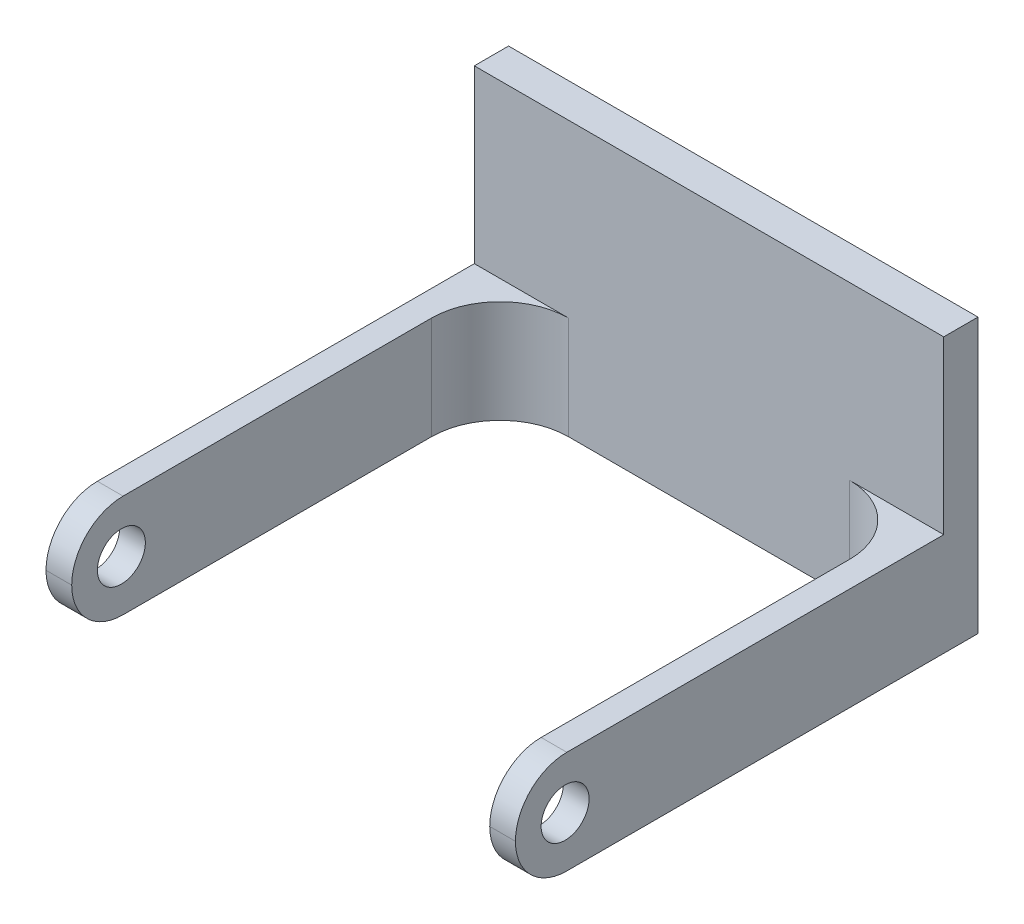
ISO-10303-21;
HEADER;
FILE_DESCRIPTION(('STEP AP214'),'2;1');
FILE_NAME('part.step','',(''),(''),'','','');
FILE_SCHEMA(('AUTOMOTIVE_DESIGN { 1 0 10303 214 1 1 1 1 }'));
ENDSEC;
DATA;
#1=APPLICATION_CONTEXT('core data for automotive mechanical design processes');
#2=APPLICATION_PROTOCOL_DEFINITION('international standard','automotive_design',2000,#1);
#3=PRODUCT_CONTEXT('',#1,'mechanical');
#4=PRODUCT('Part','Part','',(#3));
#5=PRODUCT_RELATED_PRODUCT_CATEGORY('part','',(#4));
#6=PRODUCT_DEFINITION_FORMATION('','',#4);
#7=PRODUCT_DEFINITION_CONTEXT('part definition',#1,'design');
#8=PRODUCT_DEFINITION('design','',#6,#7);
#9=PRODUCT_DEFINITION_SHAPE('','',#8);
#10=(LENGTH_UNIT() NAMED_UNIT(*) SI_UNIT(.MILLI.,.METRE.));
#11=(NAMED_UNIT(*) PLANE_ANGLE_UNIT() SI_UNIT($,.RADIAN.));
#12=(NAMED_UNIT(*) SI_UNIT($,.STERADIAN.) SOLID_ANGLE_UNIT());
#13=UNCERTAINTY_MEASURE_WITH_UNIT(LENGTH_MEASURE(1.E-05),#10,'distance_accuracy_value','');
#14=(GEOMETRIC_REPRESENTATION_CONTEXT(3) GLOBAL_UNCERTAINTY_ASSIGNED_CONTEXT((#13)) GLOBAL_UNIT_ASSIGNED_CONTEXT((#10,
#11,#12)) REPRESENTATION_CONTEXT('',''));
#15=CARTESIAN_POINT('',(0.,0.,0.));
#16=DIRECTION('',(0.,0.,1.));
#17=DIRECTION('',(1.,0.,0.));
#18=AXIS2_PLACEMENT_3D('',#15,#16,#17);
#19=CARTESIAN_POINT('',(-13.7,3.,2.));
#20=DIRECTION('',(0.,-1.,0.));
#21=DIRECTION('',(0.,0.,-1.));
#22=AXIS2_PLACEMENT_3D('',#19,#20,#21);
#23=PLANE('',#22);
#24=DIRECTION('',(1.,0.,0.));
#25=VECTOR('',#24,1.);
#26=CARTESIAN_POINT('',(-13.7,3.,2.));
#27=LINE('',#26,#25);
#28=CARTESIAN_POINT('',(-13.7,3.,2.));
#29=VERTEX_POINT('',#28);
#30=CARTESIAN_POINT('',(-8.19999999999996,3.,2.));
#31=VERTEX_POINT('',#30);
#32=EDGE_CURVE('E158',#29,#31,#27,.T.);
#33=ORIENTED_EDGE('',*,*,#32,.F.);
#34=DIRECTION('',(0.,0.,-1.));
#35=VECTOR('',#34,1.);
#36=CARTESIAN_POINT('',(-13.7,3.,2.));
#37=LINE('',#36,#35);
#38=CARTESIAN_POINT('',(-13.7,3.,24.));
#39=VERTEX_POINT('',#38);
#40=EDGE_CURVE('E164',#39,#29,#37,.T.);
#41=ORIENTED_EDGE('',*,*,#40,.F.);
#42=DIRECTION('',(-1.,0.,0.));
#43=VECTOR('',#42,1.);
#44=CARTESIAN_POINT('',(-12.2,3.,24.));
#45=LINE('',#44,#43);
#46=CARTESIAN_POINT('',(-12.2,3.,24.));
#47=VERTEX_POINT('',#46);
#48=EDGE_CURVE('E238',#39,#47,#45,.F.);
#49=ORIENTED_EDGE('',*,*,#48,.T.);
#50=DIRECTION('',(0.,0.,-1.));
#51=VECTOR('',#50,1.);
#52=CARTESIAN_POINT('',(-12.2,3.,27.));
#53=LINE('',#52,#51);
#54=CARTESIAN_POINT('',(-12.2,3.,6.));
#55=VERTEX_POINT('',#54);
#56=EDGE_CURVE('E209',#47,#55,#53,.T.);
#57=ORIENTED_EDGE('',*,*,#56,.T.);
#58=CARTESIAN_POINT('',(-8.19999999999996,3.,6.));
#59=DIRECTION('',(0.,-1.,0.));
#60=DIRECTION('',(0.,0.,-1.));
#61=AXIS2_PLACEMENT_3D('',#58,#59,#60);
#62=CIRCLE('',#61,4.);
#63=EDGE_CURVE('E42',#55,#31,#62,.T.);
#64=ORIENTED_EDGE('',*,*,#63,.T.);
#65=EDGE_LOOP('',(#33,#41,#49,#57,#64));
#66=FACE_BOUND('',#65,.T.);
#67=ADVANCED_FACE('F34',(#66),#23,.F.);
#68=CARTESIAN_POINT('',(8.20000000000003,3.,2.));
#69=VERTEX_POINT('',#68);
#70=CARTESIAN_POINT('',(13.7,3.,2.));
#71=VERTEX_POINT('',#70);
#72=EDGE_CURVE('E174',#69,#71,#27,.T.);
#73=ORIENTED_EDGE('',*,*,#72,.F.);
#74=CARTESIAN_POINT('',(8.20000000000004,3.,6.));
#75=DIRECTION('',(0.,-1.,0.));
#76=DIRECTION('',(0.,0.,-1.));
#77=AXIS2_PLACEMENT_3D('',#74,#75,#76);
#78=CIRCLE('',#77,4.);
#79=CARTESIAN_POINT('',(12.2,3.,6.));
#80=VERTEX_POINT('',#79);
#81=EDGE_CURVE('E325',#69,#80,#78,.T.);
#82=ORIENTED_EDGE('',*,*,#81,.T.);
#83=DIRECTION('',(0.,0.,-1.));
#84=VECTOR('',#83,1.);
#85=CARTESIAN_POINT('',(12.2,3.,27.));
#86=LINE('',#85,#84);
#87=CARTESIAN_POINT('',(12.2,3.,24.));
#88=VERTEX_POINT('',#87);
#89=EDGE_CURVE('E212',#88,#80,#86,.T.);
#90=ORIENTED_EDGE('',*,*,#89,.F.);
#91=DIRECTION('',(-1.,0.,0.));
#92=VECTOR('',#91,1.);
#93=CARTESIAN_POINT('',(-13.7,3.,24.));
#94=LINE('',#93,#92);
#95=CARTESIAN_POINT('',(13.7,3.,24.));
#96=VERTEX_POINT('',#95);
#97=EDGE_CURVE('E236',#88,#96,#94,.F.);
#98=ORIENTED_EDGE('',*,*,#97,.T.);
#99=DIRECTION('',(0.,0.,-1.));
#100=VECTOR('',#99,1.);
#101=CARTESIAN_POINT('',(13.7,3.,2.));
#102=LINE('',#101,#100);
#103=EDGE_CURVE('E201',#96,#71,#102,.T.);
#104=ORIENTED_EDGE('',*,*,#103,.T.);
#105=EDGE_LOOP('',(#73,#82,#90,#98,#104));
#106=FACE_BOUND('',#105,.T.);
#107=ADVANCED_FACE('F286',(#106),#23,.F.);
#108=CARTESIAN_POINT('',(0.,0.,2.));
#109=DIRECTION('',(0.,0.,-1.));
#110=DIRECTION('',(-1.,0.,0.));
#111=AXIS2_PLACEMENT_3D('',#108,#109,#110);
#112=PLANE('',#111);
#113=DIRECTION('',(1.,0.,0.));
#114=VECTOR('',#113,1.);
#115=CARTESIAN_POINT('',(-13.7,-3.,2.));
#116=LINE('',#115,#114);
#117=CARTESIAN_POINT('',(-8.19999999999996,-3.,2.));
#118=VERTEX_POINT('',#117);
#119=CARTESIAN_POINT('',(8.20000000000003,-3.,2.));
#120=VERTEX_POINT('',#119);
#121=EDGE_CURVE('E190',#118,#120,#116,.T.);
#122=ORIENTED_EDGE('',*,*,#121,.T.);
#123=DIRECTION('',(0.,-1.,0.));
#124=VECTOR('',#123,1.);
#125=CARTESIAN_POINT('',(8.20000000000004,3.,2.));
#126=LINE('',#125,#124);
#127=EDGE_CURVE('E327',#120,#69,#126,.F.);
#128=ORIENTED_EDGE('',*,*,#127,.T.);
#129=ORIENTED_EDGE('',*,*,#72,.T.);
#130=DIRECTION('',(0.,-1.,0.));
#131=VECTOR('',#130,1.);
#132=CARTESIAN_POINT('',(13.7,13.,2.));
#133=LINE('',#132,#131);
#134=CARTESIAN_POINT('',(13.7,13.,2.));
#135=VERTEX_POINT('',#134);
#136=EDGE_CURVE('E144',#135,#71,#133,.T.);
#137=ORIENTED_EDGE('',*,*,#136,.F.);
#138=DIRECTION('',(1.,0.,0.));
#139=VECTOR('',#138,1.);
#140=CARTESIAN_POINT('',(-13.7,13.,2.));
#141=LINE('',#140,#139);
#142=CARTESIAN_POINT('',(-13.7,13.,2.));
#143=VERTEX_POINT('',#142);
#144=EDGE_CURVE('E136',#143,#135,#141,.T.);
#145=ORIENTED_EDGE('',*,*,#144,.F.);
#146=DIRECTION('',(0.,-1.,0.));
#147=VECTOR('',#146,1.);
#148=CARTESIAN_POINT('',(-13.7,13.,2.));
#149=LINE('',#148,#147);
#150=EDGE_CURVE('E141',#143,#29,#149,.T.);
#151=ORIENTED_EDGE('',*,*,#150,.T.);
#152=ORIENTED_EDGE('',*,*,#32,.T.);
#153=DIRECTION('',(0.,1.,0.));
#154=VECTOR('',#153,1.);
#155=CARTESIAN_POINT('',(-8.19999999999996,-3.,2.));
#156=LINE('',#155,#154);
#157=EDGE_CURVE('E246',#31,#118,#156,.F.);
#158=ORIENTED_EDGE('',*,*,#157,.T.);
#159=EDGE_LOOP('',(#122,#128,#129,#137,#145,#151,#152,#158));
#160=FACE_BOUND('',#159,.T.);
#161=ADVANCED_FACE('F139',(#160),#112,.F.);
#162=CARTESIAN_POINT('',(13.7,-3.,2.));
#163=DIRECTION('',(-1.,0.,0.));
#164=DIRECTION('',(0.,0.,1.));
#165=AXIS2_PLACEMENT_3D('',#162,#163,#164);
#166=PLANE('',#165);
#167=CARTESIAN_POINT('',(13.7,0.,24.1));
#168=DIRECTION('',(1.,0.,0.));
#169=DIRECTION('',(0.,0.,-1.));
#170=AXIS2_PLACEMENT_3D('',#167,#168,#169);
#171=CIRCLE('',#170,1.4);
#172=CARTESIAN_POINT('',(13.7,0.,22.7));
#173=VERTEX_POINT('',#172);
#174=EDGE_CURVE('E242',#173,#173,#171,.T.);
#175=ORIENTED_EDGE('',*,*,#174,.F.);
#176=EDGE_LOOP('',(#175));
#177=FACE_BOUND('',#176,.T.);
#178=CARTESIAN_POINT('',(13.7,0.,24.));
#179=DIRECTION('',(-1.,0.,0.));
#180=DIRECTION('',(0.,0.,1.));
#181=AXIS2_PLACEMENT_3D('',#178,#179,#180);
#182=CIRCLE('',#181,3.);
#183=CARTESIAN_POINT('',(13.7,0.,27.));
#184=VERTEX_POINT('',#183);
#185=EDGE_CURVE('E228',#96,#184,#182,.F.);
#186=ORIENTED_EDGE('',*,*,#185,.T.);
#187=CARTESIAN_POINT('',(13.7,0.,24.));
#188=DIRECTION('',(-1.,0.,0.));
#189=DIRECTION('',(0.,0.,1.));
#190=AXIS2_PLACEMENT_3D('',#187,#188,#189);
#191=CIRCLE('',#190,3.);
#192=CARTESIAN_POINT('',(13.7,-3.,24.));
#193=VERTEX_POINT('',#192);
#194=EDGE_CURVE('E230',#184,#193,#191,.F.);
#195=ORIENTED_EDGE('',*,*,#194,.T.);
#196=DIRECTION('',(0.,0.,-1.));
#197=VECTOR('',#196,1.);
#198=CARTESIAN_POINT('',(13.7,-3.,2.));
#199=LINE('',#198,#197);
#200=CARTESIAN_POINT('',(13.7,-3.,0.));
#201=VERTEX_POINT('',#200);
#202=EDGE_CURVE('E196',#193,#201,#199,.T.);
#203=ORIENTED_EDGE('',*,*,#202,.T.);
#204=DIRECTION('',(0.,1.,0.));
#205=VECTOR('',#204,1.);
#206=CARTESIAN_POINT('',(13.7,-3.,0.));
#207=LINE('',#206,#205);
#208=CARTESIAN_POINT('',(13.7,13.,0.));
#209=VERTEX_POINT('',#208);
#210=EDGE_CURVE('E185',#201,#209,#207,.T.);
#211=ORIENTED_EDGE('',*,*,#210,.T.);
#212=DIRECTION('',(0.,0.,-1.));
#213=VECTOR('',#212,1.);
#214=CARTESIAN_POINT('',(13.7,13.,0.));
#215=LINE('',#214,#213);
#216=EDGE_CURVE('E148',#135,#209,#215,.T.);
#217=ORIENTED_EDGE('',*,*,#216,.F.);
#218=ORIENTED_EDGE('',*,*,#136,.T.);
#219=ORIENTED_EDGE('',*,*,#103,.F.);
#220=EDGE_LOOP('',(#186,#195,#203,#211,#217,#218,#219));
#221=FACE_BOUND('',#220,.T.);
#222=ADVANCED_FACE('F297',(#177,#221),#166,.F.);
#223=CARTESIAN_POINT('',(-13.7,-3.,2.));
#224=DIRECTION('',(1.,0.,0.));
#225=DIRECTION('',(0.,0.,-1.));
#226=AXIS2_PLACEMENT_3D('',#223,#224,#225);
#227=PLANE('',#226);
#228=CARTESIAN_POINT('',(-13.7,0.,24.1));
#229=DIRECTION('',(1.,0.,0.));
#230=DIRECTION('',(0.,0.,-1.));
#231=AXIS2_PLACEMENT_3D('',#228,#229,#230);
#232=CIRCLE('',#231,1.4);
#233=CARTESIAN_POINT('',(-13.7,0.,22.7));
#234=VERTEX_POINT('',#233);
#235=EDGE_CURVE('E260',#234,#234,#232,.T.);
#236=ORIENTED_EDGE('',*,*,#235,.T.);
#237=EDGE_LOOP('',(#236));
#238=FACE_BOUND('',#237,.T.);
#239=DIRECTION('',(0.,0.,-1.));
#240=VECTOR('',#239,1.);
#241=CARTESIAN_POINT('',(-13.7,-3.,2.));
#242=LINE('',#241,#240);
#243=CARTESIAN_POINT('',(-13.7,-3.,24.));
#244=VERTEX_POINT('',#243);
#245=CARTESIAN_POINT('',(-13.7,-3.,0.));
#246=VERTEX_POINT('',#245);
#247=EDGE_CURVE('E198',#244,#246,#242,.T.);
#248=ORIENTED_EDGE('',*,*,#247,.F.);
#249=CARTESIAN_POINT('',(-13.7,0.,24.));
#250=DIRECTION('',(1.,0.,0.));
#251=DIRECTION('',(0.,0.,-1.));
#252=AXIS2_PLACEMENT_3D('',#249,#250,#251);
#253=CIRCLE('',#252,3.);
#254=CARTESIAN_POINT('',(-13.7,0.,27.));
#255=VERTEX_POINT('',#254);
#256=EDGE_CURVE('E226',#244,#255,#253,.F.);
#257=ORIENTED_EDGE('',*,*,#256,.T.);
#258=CARTESIAN_POINT('',(-13.7,0.,24.));
#259=DIRECTION('',(1.,0.,0.));
#260=DIRECTION('',(0.,0.,-1.));
#261=AXIS2_PLACEMENT_3D('',#258,#259,#260);
#262=CIRCLE('',#261,3.);
#263=EDGE_CURVE('E224',#255,#39,#262,.F.);
#264=ORIENTED_EDGE('',*,*,#263,.T.);
#265=ORIENTED_EDGE('',*,*,#40,.T.);
#266=ORIENTED_EDGE('',*,*,#150,.F.);
#267=DIRECTION('',(0.,0.,1.));
#268=VECTOR('',#267,1.);
#269=CARTESIAN_POINT('',(-13.7,13.,0.));
#270=LINE('',#269,#268);
#271=CARTESIAN_POINT('',(-13.7,13.,0.));
#272=VERTEX_POINT('',#271);
#273=EDGE_CURVE('E149',#272,#143,#270,.T.);
#274=ORIENTED_EDGE('',*,*,#273,.F.);
#275=DIRECTION('',(0.,-1.,0.));
#276=VECTOR('',#275,1.);
#277=CARTESIAN_POINT('',(-13.7,-3.,0.));
#278=LINE('',#277,#276);
#279=EDGE_CURVE('E186',#272,#246,#278,.T.);
#280=ORIENTED_EDGE('',*,*,#279,.T.);
#281=EDGE_LOOP('',(#248,#257,#264,#265,#266,#274,#280));
#282=FACE_BOUND('',#281,.T.);
#283=ADVANCED_FACE('F162',(#238,#282),#227,.F.);
#284=CARTESIAN_POINT('',(-13.7,-3.,2.));
#285=DIRECTION('',(0.,1.,0.));
#286=DIRECTION('',(0.,0.,1.));
#287=AXIS2_PLACEMENT_3D('',#284,#285,#286);
#288=PLANE('',#287);
#289=DIRECTION('',(0.,0.,-1.));
#290=VECTOR('',#289,1.);
#291=CARTESIAN_POINT('',(-12.2,-3.,27.));
#292=LINE('',#291,#290);
#293=CARTESIAN_POINT('',(-12.2,-3.,24.));
#294=VERTEX_POINT('',#293);
#295=CARTESIAN_POINT('',(-12.2,-3.,6.));
#296=VERTEX_POINT('',#295);
#297=EDGE_CURVE('E192',#294,#296,#292,.T.);
#298=ORIENTED_EDGE('',*,*,#297,.F.);
#299=DIRECTION('',(1.,0.,0.));
#300=VECTOR('',#299,1.);
#301=CARTESIAN_POINT('',(-13.7,-3.,24.));
#302=LINE('',#301,#300);
#303=EDGE_CURVE('E221',#294,#244,#302,.F.);
#304=ORIENTED_EDGE('',*,*,#303,.T.);
#305=ORIENTED_EDGE('',*,*,#247,.T.);
#306=DIRECTION('',(1.,0.,0.));
#307=VECTOR('',#306,1.);
#308=CARTESIAN_POINT('',(-13.7,-3.,0.));
#309=LINE('',#308,#307);
#310=EDGE_CURVE('E188',#246,#201,#309,.T.);
#311=ORIENTED_EDGE('',*,*,#310,.T.);
#312=ORIENTED_EDGE('',*,*,#202,.F.);
#313=DIRECTION('',(1.,0.,0.));
#314=VECTOR('',#313,1.);
#315=CARTESIAN_POINT('',(-13.7,-3.,24.));
#316=LINE('',#315,#314);
#317=CARTESIAN_POINT('',(12.2,-3.,24.));
#318=VERTEX_POINT('',#317);
#319=EDGE_CURVE('E218',#193,#318,#316,.F.);
#320=ORIENTED_EDGE('',*,*,#319,.T.);
#321=DIRECTION('',(0.,0.,-1.));
#322=VECTOR('',#321,1.);
#323=CARTESIAN_POINT('',(12.2,-3.,27.));
#324=LINE('',#323,#322);
#325=CARTESIAN_POINT('',(12.2,-3.,6.));
#326=VERTEX_POINT('',#325);
#327=EDGE_CURVE('E253',#318,#326,#324,.T.);
#328=ORIENTED_EDGE('',*,*,#327,.T.);
#329=CARTESIAN_POINT('',(8.20000000000004,-3.,6.));
#330=DIRECTION('',(0.,1.,0.));
#331=DIRECTION('',(0.,0.,1.));
#332=AXIS2_PLACEMENT_3D('',#329,#330,#331);
#333=CIRCLE('',#332,4.);
#334=EDGE_CURVE('E329',#326,#120,#333,.T.);
#335=ORIENTED_EDGE('',*,*,#334,.T.);
#336=ORIENTED_EDGE('',*,*,#121,.F.);
#337=CARTESIAN_POINT('',(-8.19999999999996,-3.,6.));
#338=DIRECTION('',(0.,1.,0.));
#339=DIRECTION('',(0.,0.,1.));
#340=AXIS2_PLACEMENT_3D('',#337,#338,#339);
#341=CIRCLE('',#340,4.);
#342=EDGE_CURVE('E11',#118,#296,#341,.T.);
#343=ORIENTED_EDGE('',*,*,#342,.T.);
#344=EDGE_LOOP('',(#298,#304,#305,#311,#312,#320,#328,#335,#336,#343));
#345=FACE_BOUND('',#344,.T.);
#346=ADVANCED_FACE('F334',(#345),#288,.F.);
#347=CARTESIAN_POINT('',(0.,0.,0.));
#348=DIRECTION('',(0.,0.,-1.));
#349=DIRECTION('',(-1.,0.,0.));
#350=AXIS2_PLACEMENT_3D('',#347,#348,#349);
#351=PLANE('',#350);
#352=ORIENTED_EDGE('',*,*,#210,.F.);
#353=ORIENTED_EDGE('',*,*,#310,.F.);
#354=ORIENTED_EDGE('',*,*,#279,.F.);
#355=DIRECTION('',(-1.,0.,0.));
#356=VECTOR('',#355,1.);
#357=CARTESIAN_POINT('',(-13.7,13.,0.));
#358=LINE('',#357,#356);
#359=EDGE_CURVE('E155',#209,#272,#358,.T.);
#360=ORIENTED_EDGE('',*,*,#359,.F.);
#361=EDGE_LOOP('',(#352,#353,#354,#360));
#362=FACE_BOUND('',#361,.T.);
#363=ADVANCED_FACE('F183',(#362),#351,.T.);
#364=CARTESIAN_POINT('',(-12.2,3.,27.));
#365=DIRECTION('',(-1.,0.,0.));
#366=DIRECTION('',(0.,0.,1.));
#367=AXIS2_PLACEMENT_3D('',#364,#365,#366);
#368=PLANE('',#367);
#369=CARTESIAN_POINT('',(-12.2,0.,24.1));
#370=DIRECTION('',(-1.,0.,0.));
#371=DIRECTION('',(0.,0.,1.));
#372=AXIS2_PLACEMENT_3D('',#369,#370,#371);
#373=CIRCLE('',#372,1.4);
#374=CARTESIAN_POINT('',(-12.2,0.,22.7));
#375=VERTEX_POINT('',#374);
#376=EDGE_CURVE('E256',#375,#375,#373,.T.);
#377=ORIENTED_EDGE('',*,*,#376,.T.);
#378=EDGE_LOOP('',(#377));
#379=FACE_BOUND('',#378,.T.);
#380=ORIENTED_EDGE('',*,*,#297,.T.);
#381=DIRECTION('',(0.,1.,0.));
#382=VECTOR('',#381,1.);
#383=CARTESIAN_POINT('',(-12.2,3.,6.));
#384=LINE('',#383,#382);
#385=EDGE_CURVE('E331',#296,#55,#384,.T.);
#386=ORIENTED_EDGE('',*,*,#385,.T.);
#387=ORIENTED_EDGE('',*,*,#56,.F.);
#388=CARTESIAN_POINT('',(-12.2,0.,24.));
#389=DIRECTION('',(-1.,0.,0.));
#390=DIRECTION('',(0.,0.,1.));
#391=AXIS2_PLACEMENT_3D('',#388,#389,#390);
#392=CIRCLE('',#391,3.);
#393=CARTESIAN_POINT('',(-12.2,0.,27.));
#394=VERTEX_POINT('',#393);
#395=EDGE_CURVE('E203',#47,#394,#392,.F.);
#396=ORIENTED_EDGE('',*,*,#395,.T.);
#397=CARTESIAN_POINT('',(-12.2,0.,24.));
#398=DIRECTION('',(-1.,0.,0.));
#399=DIRECTION('',(0.,0.,1.));
#400=AXIS2_PLACEMENT_3D('',#397,#398,#399);
#401=CIRCLE('',#400,3.);
#402=EDGE_CURVE('E216',#394,#294,#401,.F.);
#403=ORIENTED_EDGE('',*,*,#402,.T.);
#404=EDGE_LOOP('',(#380,#386,#387,#396,#403));
#405=FACE_BOUND('',#404,.T.);
#406=ADVANCED_FACE('F282',(#379,#405),#368,.F.);
#407=CARTESIAN_POINT('',(12.2,3.,27.));
#408=DIRECTION('',(1.,0.,0.));
#409=DIRECTION('',(0.,0.,-1.));
#410=AXIS2_PLACEMENT_3D('',#407,#408,#409);
#411=PLANE('',#410);
#412=CARTESIAN_POINT('',(12.2,0.,24.1));
#413=DIRECTION('',(1.,0.,0.));
#414=DIRECTION('',(0.,0.,-1.));
#415=AXIS2_PLACEMENT_3D('',#412,#413,#414);
#416=CIRCLE('',#415,1.4);
#417=CARTESIAN_POINT('',(12.2,0.,22.7));
#418=VERTEX_POINT('',#417);
#419=EDGE_CURVE('E213',#418,#418,#416,.T.);
#420=ORIENTED_EDGE('',*,*,#419,.T.);
#421=EDGE_LOOP('',(#420));
#422=FACE_BOUND('',#421,.T.);
#423=ORIENTED_EDGE('',*,*,#89,.T.);
#424=DIRECTION('',(0.,-1.,0.));
#425=VECTOR('',#424,1.);
#426=CARTESIAN_POINT('',(12.2,-3.,6.));
#427=LINE('',#426,#425);
#428=EDGE_CURVE('E240',#80,#326,#427,.T.);
#429=ORIENTED_EDGE('',*,*,#428,.T.);
#430=ORIENTED_EDGE('',*,*,#327,.F.);
#431=CARTESIAN_POINT('',(12.2,0.,24.));
#432=DIRECTION('',(1.,0.,0.));
#433=DIRECTION('',(0.,0.,-1.));
#434=AXIS2_PLACEMENT_3D('',#431,#432,#433);
#435=CIRCLE('',#434,3.);
#436=CARTESIAN_POINT('',(12.2,0.,27.));
#437=VERTEX_POINT('',#436);
#438=EDGE_CURVE('E234',#318,#437,#435,.F.);
#439=ORIENTED_EDGE('',*,*,#438,.T.);
#440=CARTESIAN_POINT('',(12.2,0.,24.));
#441=DIRECTION('',(1.,0.,0.));
#442=DIRECTION('',(0.,0.,-1.));
#443=AXIS2_PLACEMENT_3D('',#440,#441,#442);
#444=CIRCLE('',#443,3.);
#445=EDGE_CURVE('E232',#437,#88,#444,.F.);
#446=ORIENTED_EDGE('',*,*,#445,.T.);
#447=EDGE_LOOP('',(#423,#429,#430,#439,#446));
#448=FACE_BOUND('',#447,.T.);
#449=ADVANCED_FACE('F267',(#422,#448),#411,.F.);
#450=CARTESIAN_POINT('',(-13.7,0.,24.1));
#451=DIRECTION('',(1.,0.,0.));
#452=DIRECTION('',(0.,0.,-1.));
#453=AXIS2_PLACEMENT_3D('',#450,#451,#452);
#454=CYLINDRICAL_SURFACE('',#453,1.4);
#455=CARTESIAN_POINT('',(13.7,0.,22.7));
#456=CARTESIAN_POINT('',(13.684375,0.,22.7));
#457=CARTESIAN_POINT('',(13.66875,0.,22.7));
#458=CARTESIAN_POINT('',(13.6375,0.,22.7));
#459=CARTESIAN_POINT('',(13.621875,0.,22.7));
#460=CARTESIAN_POINT('',(13.590625,0.,22.7));
#461=CARTESIAN_POINT('',(13.575,0.,22.7));
#462=CARTESIAN_POINT('',(13.54375,0.,22.7));
#463=CARTESIAN_POINT('',(13.528125,0.,22.7));
#464=CARTESIAN_POINT('',(13.496875,0.,22.7));
#465=CARTESIAN_POINT('',(13.48125,0.,22.7));
#466=CARTESIAN_POINT('',(13.45,0.,22.7));
#467=CARTESIAN_POINT('',(13.434375,0.,22.7));
#468=CARTESIAN_POINT('',(13.403125,0.,22.7));
#469=CARTESIAN_POINT('',(13.3875,0.,22.7));
#470=CARTESIAN_POINT('',(13.35625,0.,22.7));
#471=CARTESIAN_POINT('',(13.340625,0.,22.7));
#472=CARTESIAN_POINT('',(13.309375,0.,22.7));
#473=CARTESIAN_POINT('',(13.29375,0.,22.7));
#474=CARTESIAN_POINT('',(13.2625,0.,22.7));
#475=CARTESIAN_POINT('',(13.246875,0.,22.7));
#476=CARTESIAN_POINT('',(13.215625,0.,22.7));
#477=CARTESIAN_POINT('',(13.2,0.,22.7));
#478=CARTESIAN_POINT('',(13.16875,0.,22.7));
#479=CARTESIAN_POINT('',(13.153125,0.,22.7));
#480=CARTESIAN_POINT('',(13.121875,0.,22.7));
#481=CARTESIAN_POINT('',(13.10625,0.,22.7));
#482=CARTESIAN_POINT('',(13.075,0.,22.7));
#483=CARTESIAN_POINT('',(13.059375,0.,22.7));
#484=CARTESIAN_POINT('',(13.028125,0.,22.7));
#485=CARTESIAN_POINT('',(13.0125,0.,22.7));
#486=CARTESIAN_POINT('',(12.98125,0.,22.7));
#487=CARTESIAN_POINT('',(12.965625,0.,22.7));
#488=CARTESIAN_POINT('',(12.934375,0.,22.7));
#489=CARTESIAN_POINT('',(12.91875,0.,22.7));
#490=CARTESIAN_POINT('',(12.8875,0.,22.7));
#491=CARTESIAN_POINT('',(12.871875,0.,22.7));
#492=CARTESIAN_POINT('',(12.840625,0.,22.7));
#493=CARTESIAN_POINT('',(12.825,0.,22.7));
#494=CARTESIAN_POINT('',(12.79375,0.,22.7));
#495=CARTESIAN_POINT('',(12.778125,0.,22.7));
#496=CARTESIAN_POINT('',(12.746875,0.,22.7));
#497=CARTESIAN_POINT('',(12.73125,0.,22.7));
#498=CARTESIAN_POINT('',(12.7,0.,22.7));
#499=CARTESIAN_POINT('',(12.684375,0.,22.7));
#500=CARTESIAN_POINT('',(12.653125,0.,22.7));
#501=CARTESIAN_POINT('',(12.6375,0.,22.7));
#502=CARTESIAN_POINT('',(12.60625,0.,22.7));
#503=CARTESIAN_POINT('',(12.590625,0.,22.7));
#504=CARTESIAN_POINT('',(12.559375,0.,22.7));
#505=CARTESIAN_POINT('',(12.54375,0.,22.7));
#506=CARTESIAN_POINT('',(12.5125,0.,22.7));
#507=CARTESIAN_POINT('',(12.496875,0.,22.7));
#508=CARTESIAN_POINT('',(12.465625,0.,22.7));
#509=CARTESIAN_POINT('',(12.45,0.,22.7));
#510=CARTESIAN_POINT('',(12.41875,0.,22.7));
#511=CARTESIAN_POINT('',(12.403125,0.,22.7));
#512=CARTESIAN_POINT('',(12.371875,0.,22.7));
#513=CARTESIAN_POINT('',(12.35625,0.,22.7));
#514=CARTESIAN_POINT('',(12.325,0.,22.7));
#515=CARTESIAN_POINT('',(12.309375,0.,22.7));
#516=CARTESIAN_POINT('',(12.278125,0.,22.7));
#517=CARTESIAN_POINT('',(12.2625,0.,22.7));
#518=CARTESIAN_POINT('',(12.23125,0.,22.7));
#519=CARTESIAN_POINT('',(12.215625,0.,22.7));
#520=CARTESIAN_POINT('',(12.2,0.,22.7));
#521=B_SPLINE_CURVE_WITH_KNOTS('',3,(#455,#456,#457,#458,#459,#460,#461,#462,#463,#464,#465,
#466,#467,#468,#469,#470,#471,#472,#473,#474,#475,#476,#477,#478,#479,#480,#481,#482,#483,#484,
#485,#486,#487,#488,#489,#490,#491,#492,#493,#494,#495,#496,#497,#498,#499,#500,#501,#502,#503,
#504,#505,#506,#507,#508,#509,#510,#511,#512,#513,#514,#515,#516,#517,#518,#519,#520),
.UNSPECIFIED.,.F.,.F.,(4,2,2,2,2,2,2,2,2,2,2,2,2,2,2,2,2,2,2,2,2,2,2,2,2,2,2,2,2,2,2,2,4),(0.,
0.0468750000000018,0.0937500000000001,0.140624999999998,0.1875,0.234375000000002,0.28125,
0.328124999999999,0.375,0.421875000000002,0.46875,0.515624999999999,0.5625,0.609375000000002,
0.656250000000001,0.703124999999999,0.750000000000001,0.796875000000002,0.843750000000001,
0.890624999999999,0.937500000000001,0.984375000000003,1.03125,1.078125,1.125,1.171875,1.21875,
1.265625,1.3125,1.359375,1.40625,1.453125,1.5),.UNSPECIFIED.);
#522=EDGE_CURVE('BSEAM270',#173,#418,#521,.T.);
#523=ORIENTED_EDGE('',*,*,#174,.T.);
#524=ORIENTED_EDGE('',*,*,#419,.F.);
#525=ORIENTED_EDGE('',*,*,#522,.T.);
#526=ORIENTED_EDGE('',*,*,#522,.F.);
#527=EDGE_LOOP('',(#523,#525,#524,#526));
#528=FACE_BOUND('',#527,.T.);
#529=ADVANCED_FACE('F270',(#528),#454,.F.);
#530=CARTESIAN_POINT('',(-13.7,0.,22.7));
#531=CARTESIAN_POINT('',(-13.684375,0.,22.7));
#532=CARTESIAN_POINT('',(-13.66875,0.,22.7));
#533=CARTESIAN_POINT('',(-13.6375,0.,22.7));
#534=CARTESIAN_POINT('',(-13.621875,0.,22.7));
#535=CARTESIAN_POINT('',(-13.590625,0.,22.7));
#536=CARTESIAN_POINT('',(-13.575,0.,22.7));
#537=CARTESIAN_POINT('',(-13.54375,0.,22.7));
#538=CARTESIAN_POINT('',(-13.528125,0.,22.7));
#539=CARTESIAN_POINT('',(-13.496875,0.,22.7));
#540=CARTESIAN_POINT('',(-13.48125,0.,22.7));
#541=CARTESIAN_POINT('',(-13.45,0.,22.7));
#542=CARTESIAN_POINT('',(-13.434375,0.,22.7));
#543=CARTESIAN_POINT('',(-13.403125,0.,22.7));
#544=CARTESIAN_POINT('',(-13.3875,0.,22.7));
#545=CARTESIAN_POINT('',(-13.35625,0.,22.7));
#546=CARTESIAN_POINT('',(-13.340625,0.,22.7));
#547=CARTESIAN_POINT('',(-13.309375,0.,22.7));
#548=CARTESIAN_POINT('',(-13.29375,0.,22.7));
#549=CARTESIAN_POINT('',(-13.2625,0.,22.7));
#550=CARTESIAN_POINT('',(-13.246875,0.,22.7));
#551=CARTESIAN_POINT('',(-13.215625,0.,22.7));
#552=CARTESIAN_POINT('',(-13.2,0.,22.7));
#553=CARTESIAN_POINT('',(-13.16875,0.,22.7));
#554=CARTESIAN_POINT('',(-13.153125,0.,22.7));
#555=CARTESIAN_POINT('',(-13.121875,0.,22.7));
#556=CARTESIAN_POINT('',(-13.10625,0.,22.7));
#557=CARTESIAN_POINT('',(-13.075,0.,22.7));
#558=CARTESIAN_POINT('',(-13.059375,0.,22.7));
#559=CARTESIAN_POINT('',(-13.028125,0.,22.7));
#560=CARTESIAN_POINT('',(-13.0125,0.,22.7));
#561=CARTESIAN_POINT('',(-12.98125,0.,22.7));
#562=CARTESIAN_POINT('',(-12.965625,0.,22.7));
#563=CARTESIAN_POINT('',(-12.934375,0.,22.7));
#564=CARTESIAN_POINT('',(-12.91875,0.,22.7));
#565=CARTESIAN_POINT('',(-12.8875,0.,22.7));
#566=CARTESIAN_POINT('',(-12.871875,0.,22.7));
#567=CARTESIAN_POINT('',(-12.840625,0.,22.7));
#568=CARTESIAN_POINT('',(-12.825,0.,22.7));
#569=CARTESIAN_POINT('',(-12.79375,0.,22.7));
#570=CARTESIAN_POINT('',(-12.778125,0.,22.7));
#571=CARTESIAN_POINT('',(-12.746875,0.,22.7));
#572=CARTESIAN_POINT('',(-12.73125,0.,22.7));
#573=CARTESIAN_POINT('',(-12.7,0.,22.7));
#574=CARTESIAN_POINT('',(-12.684375,0.,22.7));
#575=CARTESIAN_POINT('',(-12.653125,0.,22.7));
#576=CARTESIAN_POINT('',(-12.6375,0.,22.7));
#577=CARTESIAN_POINT('',(-12.60625,0.,22.7));
#578=CARTESIAN_POINT('',(-12.590625,0.,22.7));
#579=CARTESIAN_POINT('',(-12.559375,0.,22.7));
#580=CARTESIAN_POINT('',(-12.54375,0.,22.7));
#581=CARTESIAN_POINT('',(-12.5125,0.,22.7));
#582=CARTESIAN_POINT('',(-12.496875,0.,22.7));
#583=CARTESIAN_POINT('',(-12.465625,0.,22.7));
#584=CARTESIAN_POINT('',(-12.45,0.,22.7));
#585=CARTESIAN_POINT('',(-12.41875,0.,22.7));
#586=CARTESIAN_POINT('',(-12.403125,0.,22.7));
#587=CARTESIAN_POINT('',(-12.371875,0.,22.7));
#588=CARTESIAN_POINT('',(-12.35625,0.,22.7));
#589=CARTESIAN_POINT('',(-12.325,0.,22.7));
#590=CARTESIAN_POINT('',(-12.309375,0.,22.7));
#591=CARTESIAN_POINT('',(-12.278125,0.,22.7));
#592=CARTESIAN_POINT('',(-12.2625,0.,22.7));
#593=CARTESIAN_POINT('',(-12.23125,0.,22.7));
#594=CARTESIAN_POINT('',(-12.215625,0.,22.7));
#595=CARTESIAN_POINT('',(-12.2,0.,22.7));
#596=B_SPLINE_CURVE_WITH_KNOTS('',3,(#530,#531,#532,#533,#534,#535,#536,#537,#538,#539,#540,
#541,#542,#543,#544,#545,#546,#547,#548,#549,#550,#551,#552,#553,#554,#555,#556,#557,#558,#559,
#560,#561,#562,#563,#564,#565,#566,#567,#568,#569,#570,#571,#572,#573,#574,#575,#576,#577,#578,
#579,#580,#581,#582,#583,#584,#585,#586,#587,#588,#589,#590,#591,#592,#593,#594,#595),
.UNSPECIFIED.,.F.,.F.,(4,2,2,2,2,2,2,2,2,2,2,2,2,2,2,2,2,2,2,2,2,2,2,2,2,2,2,2,2,2,2,2,4),(0.,
0.046875,0.0937500000000001,0.140625,0.1875,0.234375,0.28125,0.328125,0.375,0.421875,0.46875,
0.515625,0.5625,0.609375000000001,0.656250000000001,0.703125000000001,0.750000000000001,
0.796875000000001,0.843750000000001,0.890625000000001,0.937500000000001,0.984375000000001,
1.03125,1.078125,1.125,1.171875,1.21875,1.265625,1.3125,1.359375,1.40625,1.453125,1.5),.UNSPECIFIED.);
#597=EDGE_CURVE('BSEAM272',#234,#375,#596,.T.);
#598=ORIENTED_EDGE('',*,*,#235,.F.);
#599=ORIENTED_EDGE('',*,*,#376,.F.);
#600=ORIENTED_EDGE('',*,*,#597,.T.);
#601=ORIENTED_EDGE('',*,*,#597,.F.);
#602=EDGE_LOOP('',(#598,#600,#599,#601));
#603=FACE_BOUND('',#602,.T.);
#604=ADVANCED_FACE('F272',(#603),#454,.F.);
#605=CARTESIAN_POINT('',(0.,0.,24.));
#606=DIRECTION('',(1.,0.,0.));
#607=DIRECTION('',(0.,0.,-1.));
#608=AXIS2_PLACEMENT_3D('',#605,#606,#607);
#609=CYLINDRICAL_SURFACE('',#608,3.);
#610=ORIENTED_EDGE('',*,*,#48,.F.);
#611=ORIENTED_EDGE('',*,*,#263,.F.);
#612=DIRECTION('',(-1.,0.,0.));
#613=VECTOR('',#612,1.);
#614=CARTESIAN_POINT('',(-13.7,0.,27.));
#615=LINE('',#614,#613);
#616=EDGE_CURVE('E168',#394,#255,#615,.T.);
#617=ORIENTED_EDGE('',*,*,#616,.F.);
#618=ORIENTED_EDGE('',*,*,#395,.F.);
#619=EDGE_LOOP('',(#610,#611,#617,#618));
#620=FACE_BOUND('',#619,.T.);
#621=ADVANCED_FACE('F279',(#620),#609,.T.);
#622=CARTESIAN_POINT('',(0.,0.,24.));
#623=DIRECTION('',(-1.,0.,0.));
#624=DIRECTION('',(0.,0.,1.));
#625=AXIS2_PLACEMENT_3D('',#622,#623,#624);
#626=CYLINDRICAL_SURFACE('',#625,3.);
#627=ORIENTED_EDGE('',*,*,#256,.F.);
#628=ORIENTED_EDGE('',*,*,#303,.F.);
#629=ORIENTED_EDGE('',*,*,#402,.F.);
#630=ORIENTED_EDGE('',*,*,#616,.T.);
#631=EDGE_LOOP('',(#627,#628,#629,#630));
#632=FACE_BOUND('',#631,.T.);
#633=ADVANCED_FACE('F301',(#632),#626,.T.);
#634=CARTESIAN_POINT('',(0.,0.,24.));
#635=DIRECTION('',(-1.,0.,0.));
#636=DIRECTION('',(0.,0.,1.));
#637=AXIS2_PLACEMENT_3D('',#634,#635,#636);
#638=CYLINDRICAL_SURFACE('',#637,3.);
#639=ORIENTED_EDGE('',*,*,#97,.F.);
#640=ORIENTED_EDGE('',*,*,#445,.F.);
#641=DIRECTION('',(-1.,0.,0.));
#642=VECTOR('',#641,1.);
#643=CARTESIAN_POINT('',(0.,0.,27.));
#644=LINE('',#643,#642);
#645=EDGE_CURVE('E165',#184,#437,#644,.T.);
#646=ORIENTED_EDGE('',*,*,#645,.F.);
#647=ORIENTED_EDGE('',*,*,#185,.F.);
#648=EDGE_LOOP('',(#639,#640,#646,#647));
#649=FACE_BOUND('',#648,.T.);
#650=ADVANCED_FACE('F304',(#649),#638,.T.);
#651=CARTESIAN_POINT('',(0.,0.,24.));
#652=DIRECTION('',(1.,0.,0.));
#653=DIRECTION('',(0.,0.,-1.));
#654=AXIS2_PLACEMENT_3D('',#651,#652,#653);
#655=CYLINDRICAL_SURFACE('',#654,3.);
#656=ORIENTED_EDGE('',*,*,#438,.F.);
#657=ORIENTED_EDGE('',*,*,#319,.F.);
#658=ORIENTED_EDGE('',*,*,#194,.F.);
#659=ORIENTED_EDGE('',*,*,#645,.T.);
#660=EDGE_LOOP('',(#656,#657,#658,#659));
#661=FACE_BOUND('',#660,.T.);
#662=ADVANCED_FACE('F309',(#661),#655,.T.);
#663=CARTESIAN_POINT('',(0.,13.,0.));
#664=DIRECTION('',(0.,1.,0.));
#665=DIRECTION('',(0.,0.,1.));
#666=AXIS2_PLACEMENT_3D('',#663,#664,#665);
#667=PLANE('',#666);
#668=ORIENTED_EDGE('',*,*,#273,.T.);
#669=ORIENTED_EDGE('',*,*,#144,.T.);
#670=ORIENTED_EDGE('',*,*,#216,.T.);
#671=ORIENTED_EDGE('',*,*,#359,.T.);
#672=EDGE_LOOP('',(#668,#669,#670,#671));
#673=FACE_BOUND('',#672,.T.);
#674=ADVANCED_FACE('F153',(#673),#667,.T.);
#675=CARTESIAN_POINT('',(8.20000000000004,3.,6.));
#676=DIRECTION('',(0.,1.,0.));
#677=DIRECTION('',(0.,0.,1.));
#678=AXIS2_PLACEMENT_3D('',#675,#676,#677);
#679=CYLINDRICAL_SURFACE('',#678,4.);
#680=ORIENTED_EDGE('',*,*,#81,.F.);
#681=ORIENTED_EDGE('',*,*,#127,.F.);
#682=ORIENTED_EDGE('',*,*,#334,.F.);
#683=ORIENTED_EDGE('',*,*,#428,.F.);
#684=EDGE_LOOP('',(#680,#681,#682,#683));
#685=FACE_BOUND('',#684,.T.);
#686=ADVANCED_FACE('F315',(#685),#679,.F.);
#687=CARTESIAN_POINT('',(-8.19999999999996,3.,6.));
#688=DIRECTION('',(0.,-1.,0.));
#689=DIRECTION('',(0.,0.,-1.));
#690=AXIS2_PLACEMENT_3D('',#687,#688,#689);
#691=CYLINDRICAL_SURFACE('',#690,4.);
#692=ORIENTED_EDGE('',*,*,#342,.F.);
#693=ORIENTED_EDGE('',*,*,#157,.F.);
#694=ORIENTED_EDGE('',*,*,#63,.F.);
#695=ORIENTED_EDGE('',*,*,#385,.F.);
#696=EDGE_LOOP('',(#692,#693,#694,#695));
#697=FACE_BOUND('',#696,.T.);
#698=ADVANCED_FACE('F36',(#697),#691,.F.);
#699=CLOSED_SHELL('',(#67,#107,#161,#222,#283,#346,#363,#406,#449,#529,#604,#621,#633,#650,#662,
#674,#686,#698));
#700=MANIFOLD_SOLID_BREP('B2',#699);
#701=ADVANCED_BREP_SHAPE_REPRESENTATION('',(#18,#700),#14);
#702=SHAPE_DEFINITION_REPRESENTATION(#9,#701);
ENDSEC;
END-ISO-10303-21;
